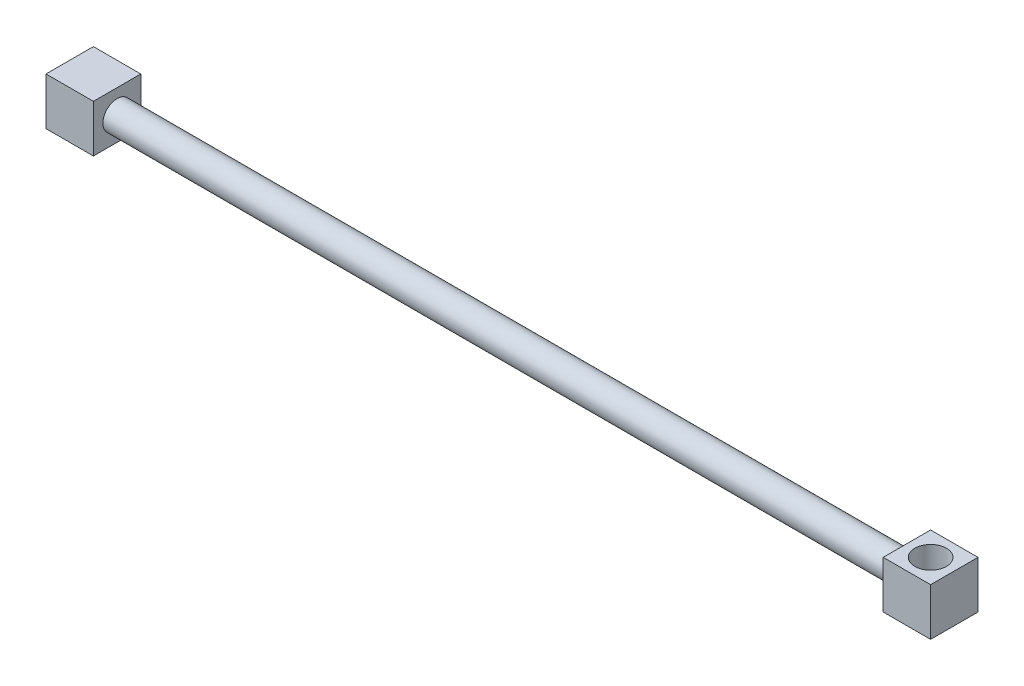
ISO-10303-21;
HEADER;
FILE_DESCRIPTION(('STEP AP214'),'2;1');
FILE_NAME('part.step','',(''),(''),'','','');
FILE_SCHEMA(('AUTOMOTIVE_DESIGN { 1 0 10303 214 1 1 1 1 }'));
ENDSEC;
DATA;
#1=APPLICATION_CONTEXT('core data for automotive mechanical design processes');
#2=APPLICATION_PROTOCOL_DEFINITION('international standard','automotive_design',2000,#1);
#3=PRODUCT_CONTEXT('',#1,'mechanical');
#4=PRODUCT('Part','Part','',(#3));
#5=PRODUCT_RELATED_PRODUCT_CATEGORY('part','',(#4));
#6=PRODUCT_DEFINITION_FORMATION('','',#4);
#7=PRODUCT_DEFINITION_CONTEXT('part definition',#1,'design');
#8=PRODUCT_DEFINITION('design','',#6,#7);
#9=PRODUCT_DEFINITION_SHAPE('','',#8);
#10=(LENGTH_UNIT() NAMED_UNIT(*) SI_UNIT(.MILLI.,.METRE.));
#11=(NAMED_UNIT(*) PLANE_ANGLE_UNIT() SI_UNIT($,.RADIAN.));
#12=(NAMED_UNIT(*) SI_UNIT($,.STERADIAN.) SOLID_ANGLE_UNIT());
#13=UNCERTAINTY_MEASURE_WITH_UNIT(LENGTH_MEASURE(1.E-05),#10,'distance_accuracy_value','');
#14=(GEOMETRIC_REPRESENTATION_CONTEXT(3) GLOBAL_UNCERTAINTY_ASSIGNED_CONTEXT((#13)) GLOBAL_UNIT_ASSIGNED_CONTEXT((#10,
#11,#12)) REPRESENTATION_CONTEXT('',''));
#15=CARTESIAN_POINT('',(0.,0.,0.));
#16=DIRECTION('',(0.,0.,1.));
#17=DIRECTION('',(1.,0.,0.));
#18=AXIS2_PLACEMENT_3D('',#15,#16,#17);
#19=CARTESIAN_POINT('',(30.,15.,-15.));
#20=DIRECTION('',(0.,0.,1.));
#21=DIRECTION('',(0.,-1.,0.));
#22=AXIS2_PLACEMENT_3D('',#19,#20,#21);
#23=PLANE('',#22);
#24=DIRECTION('',(0.,1.,0.));
#25=VECTOR('',#24,1.);
#26=CARTESIAN_POINT('',(0.,15.,-15.));
#27=LINE('',#26,#25);
#28=CARTESIAN_POINT('',(0.,-15.,-15.));
#29=VERTEX_POINT('',#28);
#30=CARTESIAN_POINT('',(0.,15.,-15.));
#31=VERTEX_POINT('',#30);
#32=EDGE_CURVE('E149',#29,#31,#27,.T.);
#33=ORIENTED_EDGE('',*,*,#32,.T.);
#34=DIRECTION('',(-1.,0.,0.));
#35=VECTOR('',#34,1.);
#36=CARTESIAN_POINT('',(30.,15.,-15.));
#37=LINE('',#36,#35);
#38=CARTESIAN_POINT('',(30.,15.,-15.));
#39=VERTEX_POINT('',#38);
#40=EDGE_CURVE('E42',#39,#31,#37,.T.);
#41=ORIENTED_EDGE('',*,*,#40,.F.);
#42=DIRECTION('',(0.,1.,0.));
#43=VECTOR('',#42,1.);
#44=CARTESIAN_POINT('',(30.,15.,-15.));
#45=LINE('',#44,#43);
#46=CARTESIAN_POINT('',(30.,-15.,-15.));
#47=VERTEX_POINT('',#46);
#48=EDGE_CURVE('E155',#47,#39,#45,.T.);
#49=ORIENTED_EDGE('',*,*,#48,.F.);
#50=DIRECTION('',(-1.,0.,0.));
#51=VECTOR('',#50,1.);
#52=CARTESIAN_POINT('',(30.,-15.,-15.));
#53=LINE('',#52,#51);
#54=EDGE_CURVE('E165',#47,#29,#53,.T.);
#55=ORIENTED_EDGE('',*,*,#54,.T.);
#56=EDGE_LOOP('',(#33,#41,#49,#55));
#57=FACE_BOUND('',#56,.T.);
#58=ADVANCED_FACE('F39',(#57),#23,.F.);
#59=CARTESIAN_POINT('',(30.,15.,15.));
#60=DIRECTION('',(0.,-1.,0.));
#61=DIRECTION('',(0.,0.,-1.));
#62=AXIS2_PLACEMENT_3D('',#59,#60,#61);
#63=PLANE('',#62);
#64=DIRECTION('',(0.,0.,1.));
#65=VECTOR('',#64,1.);
#66=CARTESIAN_POINT('',(0.,15.,15.));
#67=LINE('',#66,#65);
#68=CARTESIAN_POINT('',(0.,15.,15.));
#69=VERTEX_POINT('',#68);
#70=EDGE_CURVE('E169',#31,#69,#67,.T.);
#71=ORIENTED_EDGE('',*,*,#70,.T.);
#72=DIRECTION('',(-1.,0.,0.));
#73=VECTOR('',#72,1.);
#74=CARTESIAN_POINT('',(30.,15.,15.));
#75=LINE('',#74,#73);
#76=CARTESIAN_POINT('',(30.,15.,15.));
#77=VERTEX_POINT('',#76);
#78=EDGE_CURVE('E180',#77,#69,#75,.T.);
#79=ORIENTED_EDGE('',*,*,#78,.F.);
#80=DIRECTION('',(0.,0.,1.));
#81=VECTOR('',#80,1.);
#82=CARTESIAN_POINT('',(30.,15.,15.));
#83=LINE('',#82,#81);
#84=EDGE_CURVE('E89',#39,#77,#83,.T.);
#85=ORIENTED_EDGE('',*,*,#84,.F.);
#86=ORIENTED_EDGE('',*,*,#40,.T.);
#87=EDGE_LOOP('',(#71,#79,#85,#86));
#88=FACE_BOUND('',#87,.T.);
#89=ADVANCED_FACE('F185',(#88),#63,.F.);
#90=CARTESIAN_POINT('',(30.,15.,15.));
#91=DIRECTION('',(0.,0.,-1.));
#92=DIRECTION('',(0.,1.,0.));
#93=AXIS2_PLACEMENT_3D('',#90,#91,#92);
#94=PLANE('',#93);
#95=DIRECTION('',(0.,-1.,0.));
#96=VECTOR('',#95,1.);
#97=CARTESIAN_POINT('',(0.,15.,15.));
#98=LINE('',#97,#96);
#99=CARTESIAN_POINT('',(0.,-15.,15.));
#100=VERTEX_POINT('',#99);
#101=EDGE_CURVE('E75',#69,#100,#98,.T.);
#102=ORIENTED_EDGE('',*,*,#101,.T.);
#103=DIRECTION('',(-1.,0.,0.));
#104=VECTOR('',#103,1.);
#105=CARTESIAN_POINT('',(30.,-15.,15.));
#106=LINE('',#105,#104);
#107=CARTESIAN_POINT('',(30.,-15.,15.));
#108=VERTEX_POINT('',#107);
#109=EDGE_CURVE('E178',#108,#100,#106,.T.);
#110=ORIENTED_EDGE('',*,*,#109,.F.);
#111=DIRECTION('',(0.,-1.,0.));
#112=VECTOR('',#111,1.);
#113=CARTESIAN_POINT('',(30.,15.,15.));
#114=LINE('',#113,#112);
#115=EDGE_CURVE('E160',#77,#108,#114,.T.);
#116=ORIENTED_EDGE('',*,*,#115,.F.);
#117=ORIENTED_EDGE('',*,*,#78,.T.);
#118=EDGE_LOOP('',(#102,#110,#116,#117));
#119=FACE_BOUND('',#118,.T.);
#120=ADVANCED_FACE('F209',(#119),#94,.F.);
#121=CARTESIAN_POINT('',(30.,-15.,15.));
#122=DIRECTION('',(0.,1.,0.));
#123=DIRECTION('',(0.,0.,1.));
#124=AXIS2_PLACEMENT_3D('',#121,#122,#123);
#125=PLANE('',#124);
#126=DIRECTION('',(0.,0.,-1.));
#127=VECTOR('',#126,1.);
#128=CARTESIAN_POINT('',(0.,-15.,15.));
#129=LINE('',#128,#127);
#130=EDGE_CURVE('E81',#100,#29,#129,.T.);
#131=ORIENTED_EDGE('',*,*,#130,.T.);
#132=ORIENTED_EDGE('',*,*,#54,.F.);
#133=DIRECTION('',(0.,0.,-1.));
#134=VECTOR('',#133,1.);
#135=CARTESIAN_POINT('',(30.,-15.,15.));
#136=LINE('',#135,#134);
#137=EDGE_CURVE('E57',#108,#47,#136,.T.);
#138=ORIENTED_EDGE('',*,*,#137,.F.);
#139=ORIENTED_EDGE('',*,*,#109,.T.);
#140=EDGE_LOOP('',(#131,#132,#138,#139));
#141=FACE_BOUND('',#140,.T.);
#142=ADVANCED_FACE('F201',(#141),#125,.F.);
#143=CARTESIAN_POINT('',(30.,0.,0.));
#144=DIRECTION('',(1.,0.,0.));
#145=DIRECTION('',(0.,0.,-1.));
#146=AXIS2_PLACEMENT_3D('',#143,#144,#145);
#147=PLANE('',#146);
#148=CARTESIAN_POINT('',(30.,0.,0.));
#149=DIRECTION('',(1.,0.,0.));
#150=DIRECTION('',(0.,0.,-1.));
#151=AXIS2_PLACEMENT_3D('',#148,#149,#150);
#152=CIRCLE('',#151,9.);
#153=CARTESIAN_POINT('',(30.,0.,-9.));
#154=VERTEX_POINT('',#153);
#155=EDGE_CURVE('E11',#154,#154,#152,.T.);
#156=ORIENTED_EDGE('',*,*,#155,.F.);
#157=EDGE_LOOP('',(#156));
#158=FACE_BOUND('',#157,.T.);
#159=ORIENTED_EDGE('',*,*,#48,.T.);
#160=ORIENTED_EDGE('',*,*,#84,.T.);
#161=ORIENTED_EDGE('',*,*,#115,.T.);
#162=ORIENTED_EDGE('',*,*,#137,.T.);
#163=EDGE_LOOP('',(#159,#160,#161,#162));
#164=FACE_BOUND('',#163,.T.);
#165=ADVANCED_FACE('F193',(#158,#164),#147,.T.);
#166=CARTESIAN_POINT('',(0.,0.,0.));
#167=DIRECTION('',(1.,0.,0.));
#168=DIRECTION('',(0.,0.,-1.));
#169=AXIS2_PLACEMENT_3D('',#166,#167,#168);
#170=PLANE('',#169);
#171=ORIENTED_EDGE('',*,*,#32,.F.);
#172=ORIENTED_EDGE('',*,*,#130,.F.);
#173=ORIENTED_EDGE('',*,*,#101,.F.);
#174=ORIENTED_EDGE('',*,*,#70,.F.);
#175=EDGE_LOOP('',(#171,#172,#173,#174));
#176=FACE_BOUND('',#175,.T.);
#177=ADVANCED_FACE('F190',(#176),#170,.F.);
#178=CARTESIAN_POINT('',(530.,0.,0.));
#179=DIRECTION('',(-1.,0.,0.));
#180=DIRECTION('',(0.,0.,1.));
#181=AXIS2_PLACEMENT_3D('',#178,#179,#180);
#182=CYLINDRICAL_SURFACE('',#181,9.);
#183=CARTESIAN_POINT('',(530.,0.,0.));
#184=DIRECTION('',(1.,0.,0.));
#185=DIRECTION('',(0.,0.,-1.));
#186=AXIS2_PLACEMENT_3D('',#183,#184,#185);
#187=CIRCLE('',#186,9.);
#188=CARTESIAN_POINT('',(530.,0.,-9.));
#189=VERTEX_POINT('',#188);
#190=EDGE_CURVE('E144',#189,#189,#187,.T.);
#191=ORIENTED_EDGE('',*,*,#190,.F.);
#192=EDGE_LOOP('',(#191));
#193=FACE_BOUND('',#192,.T.);
#194=ORIENTED_EDGE('',*,*,#155,.T.);
#195=EDGE_LOOP('',(#194));
#196=FACE_BOUND('',#195,.T.);
#197=ADVANCED_FACE('F192',(#193,#196),#182,.T.);
#198=CARTESIAN_POINT('',(560.,-15.,-15.));
#199=DIRECTION('',(0.,0.,1.));
#200=DIRECTION('',(1.,0.,0.));
#201=AXIS2_PLACEMENT_3D('',#198,#199,#200);
#202=PLANE('',#201);
#203=DIRECTION('',(0.,1.,0.));
#204=VECTOR('',#203,1.);
#205=CARTESIAN_POINT('',(530.,-15.,-15.));
#206=LINE('',#205,#204);
#207=CARTESIAN_POINT('',(530.,-15.,-15.));
#208=VERTEX_POINT('',#207);
#209=CARTESIAN_POINT('',(530.,15.,-15.));
#210=VERTEX_POINT('',#209);
#211=EDGE_CURVE('E142',#208,#210,#206,.T.);
#212=ORIENTED_EDGE('',*,*,#211,.T.);
#213=DIRECTION('',(-1.,0.,0.));
#214=VECTOR('',#213,1.);
#215=CARTESIAN_POINT('',(560.,15.,-15.));
#216=LINE('',#215,#214);
#217=CARTESIAN_POINT('',(560.,15.,-15.));
#218=VERTEX_POINT('',#217);
#219=EDGE_CURVE('E120',#218,#210,#216,.T.);
#220=ORIENTED_EDGE('',*,*,#219,.F.);
#221=DIRECTION('',(0.,1.,0.));
#222=VECTOR('',#221,1.);
#223=CARTESIAN_POINT('',(560.,-15.,-15.));
#224=LINE('',#223,#222);
#225=CARTESIAN_POINT('',(560.,-15.,-15.));
#226=VERTEX_POINT('',#225);
#227=EDGE_CURVE('E128',#226,#218,#224,.T.);
#228=ORIENTED_EDGE('',*,*,#227,.F.);
#229=DIRECTION('',(-1.,0.,0.));
#230=VECTOR('',#229,1.);
#231=CARTESIAN_POINT('',(560.,-15.,-15.));
#232=LINE('',#231,#230);
#233=EDGE_CURVE('E316',#226,#208,#232,.T.);
#234=ORIENTED_EDGE('',*,*,#233,.T.);
#235=EDGE_LOOP('',(#212,#220,#228,#234));
#236=FACE_BOUND('',#235,.T.);
#237=ADVANCED_FACE('F140',(#236),#202,.F.);
#238=CARTESIAN_POINT('',(560.,15.,15.));
#239=DIRECTION('',(0.,-1.,0.));
#240=DIRECTION('',(0.,0.,-1.));
#241=AXIS2_PLACEMENT_3D('',#238,#239,#240);
#242=PLANE('',#241);
#243=CARTESIAN_POINT('',(545.,15.,0.));
#244=DIRECTION('',(0.,1.,0.));
#245=DIRECTION('',(0.,0.,1.));
#246=AXIS2_PLACEMENT_3D('',#243,#244,#245);
#247=CIRCLE('',#246,9.99999999999998);
#248=CARTESIAN_POINT('',(545.,15.,9.99999999999998));
#249=VERTEX_POINT('',#248);
#250=EDGE_CURVE('E306',#249,#249,#247,.T.);
#251=ORIENTED_EDGE('',*,*,#250,.F.);
#252=EDGE_LOOP('',(#251));
#253=FACE_BOUND('',#252,.T.);
#254=DIRECTION('',(0.,0.,1.));
#255=VECTOR('',#254,1.);
#256=CARTESIAN_POINT('',(530.,15.,15.));
#257=LINE('',#256,#255);
#258=CARTESIAN_POINT('',(530.,15.,15.));
#259=VERTEX_POINT('',#258);
#260=EDGE_CURVE('E319',#210,#259,#257,.T.);
#261=ORIENTED_EDGE('',*,*,#260,.T.);
#262=DIRECTION('',(-1.,0.,0.));
#263=VECTOR('',#262,1.);
#264=CARTESIAN_POINT('',(560.,15.,15.));
#265=LINE('',#264,#263);
#266=CARTESIAN_POINT('',(560.,15.,15.));
#267=VERTEX_POINT('',#266);
#268=EDGE_CURVE('E123',#267,#259,#265,.T.);
#269=ORIENTED_EDGE('',*,*,#268,.F.);
#270=DIRECTION('',(0.,0.,1.));
#271=VECTOR('',#270,1.);
#272=CARTESIAN_POINT('',(560.,15.,15.));
#273=LINE('',#272,#271);
#274=EDGE_CURVE('E116',#218,#267,#273,.T.);
#275=ORIENTED_EDGE('',*,*,#274,.F.);
#276=ORIENTED_EDGE('',*,*,#219,.T.);
#277=EDGE_LOOP('',(#261,#269,#275,#276));
#278=FACE_BOUND('',#277,.T.);
#279=ADVANCED_FACE('F118',(#253,#278),#242,.F.);
#280=CARTESIAN_POINT('',(560.,-15.,15.));
#281=DIRECTION('',(0.,0.,-1.));
#282=DIRECTION('',(-1.,0.,0.));
#283=AXIS2_PLACEMENT_3D('',#280,#281,#282);
#284=PLANE('',#283);
#285=DIRECTION('',(0.,-1.,0.));
#286=VECTOR('',#285,1.);
#287=CARTESIAN_POINT('',(530.,-15.,15.));
#288=LINE('',#287,#286);
#289=CARTESIAN_POINT('',(530.,-15.,15.));
#290=VERTEX_POINT('',#289);
#291=EDGE_CURVE('E322',#259,#290,#288,.T.);
#292=ORIENTED_EDGE('',*,*,#291,.T.);
#293=DIRECTION('',(-1.,0.,0.));
#294=VECTOR('',#293,1.);
#295=CARTESIAN_POINT('',(560.,-15.,15.));
#296=LINE('',#295,#294);
#297=CARTESIAN_POINT('',(560.,-15.,15.));
#298=VERTEX_POINT('',#297);
#299=EDGE_CURVE('E151',#298,#290,#296,.T.);
#300=ORIENTED_EDGE('',*,*,#299,.F.);
#301=DIRECTION('',(0.,-1.,0.));
#302=VECTOR('',#301,1.);
#303=CARTESIAN_POINT('',(560.,-15.,15.));
#304=LINE('',#303,#302);
#305=EDGE_CURVE('E127',#267,#298,#304,.T.);
#306=ORIENTED_EDGE('',*,*,#305,.F.);
#307=ORIENTED_EDGE('',*,*,#268,.T.);
#308=EDGE_LOOP('',(#292,#300,#306,#307));
#309=FACE_BOUND('',#308,.T.);
#310=ADVANCED_FACE('F246',(#309),#284,.F.);
#311=CARTESIAN_POINT('',(560.,-15.,15.));
#312=DIRECTION('',(0.,1.,0.));
#313=DIRECTION('',(0.,0.,1.));
#314=AXIS2_PLACEMENT_3D('',#311,#312,#313);
#315=PLANE('',#314);
#316=CARTESIAN_POINT('',(545.,-15.,0.));
#317=DIRECTION('',(0.,1.,0.));
#318=DIRECTION('',(0.,0.,1.));
#319=AXIS2_PLACEMENT_3D('',#316,#317,#318);
#320=CIRCLE('',#319,9.99999999999998);
#321=CARTESIAN_POINT('',(545.,-15.,9.99999999999998));
#322=VERTEX_POINT('',#321);
#323=EDGE_CURVE('E303',#322,#322,#320,.F.);
#324=ORIENTED_EDGE('',*,*,#323,.F.);
#325=EDGE_LOOP('',(#324));
#326=FACE_BOUND('',#325,.T.);
#327=DIRECTION('',(0.,0.,-1.));
#328=VECTOR('',#327,1.);
#329=CARTESIAN_POINT('',(530.,-15.,15.));
#330=LINE('',#329,#328);
#331=EDGE_CURVE('E138',#290,#208,#330,.T.);
#332=ORIENTED_EDGE('',*,*,#331,.T.);
#333=ORIENTED_EDGE('',*,*,#233,.F.);
#334=DIRECTION('',(0.,0.,-1.));
#335=VECTOR('',#334,1.);
#336=CARTESIAN_POINT('',(560.,-15.,15.));
#337=LINE('',#336,#335);
#338=EDGE_CURVE('E133',#298,#226,#337,.T.);
#339=ORIENTED_EDGE('',*,*,#338,.F.);
#340=ORIENTED_EDGE('',*,*,#299,.T.);
#341=EDGE_LOOP('',(#332,#333,#339,#340));
#342=FACE_BOUND('',#341,.T.);
#343=ADVANCED_FACE('F251',(#326,#342),#315,.F.);
#344=CARTESIAN_POINT('',(560.,0.,0.));
#345=DIRECTION('',(-1.,0.,0.));
#346=DIRECTION('',(0.,0.,1.));
#347=AXIS2_PLACEMENT_3D('',#344,#345,#346);
#348=PLANE('',#347);
#349=ORIENTED_EDGE('',*,*,#227,.T.);
#350=ORIENTED_EDGE('',*,*,#274,.T.);
#351=ORIENTED_EDGE('',*,*,#305,.T.);
#352=ORIENTED_EDGE('',*,*,#338,.T.);
#353=EDGE_LOOP('',(#349,#350,#351,#352));
#354=FACE_BOUND('',#353,.T.);
#355=ADVANCED_FACE('F131',(#354),#348,.F.);
#356=CARTESIAN_POINT('',(530.,0.,0.));
#357=DIRECTION('',(-1.,0.,0.));
#358=DIRECTION('',(0.,0.,1.));
#359=AXIS2_PLACEMENT_3D('',#356,#357,#358);
#360=PLANE('',#359);
#361=ORIENTED_EDGE('',*,*,#190,.T.);
#362=EDGE_LOOP('',(#361));
#363=FACE_BOUND('',#362,.T.);
#364=ORIENTED_EDGE('',*,*,#211,.F.);
#365=ORIENTED_EDGE('',*,*,#331,.F.);
#366=ORIENTED_EDGE('',*,*,#291,.F.);
#367=ORIENTED_EDGE('',*,*,#260,.F.);
#368=EDGE_LOOP('',(#364,#365,#366,#367));
#369=FACE_BOUND('',#368,.T.);
#370=ADVANCED_FACE('F263',(#363,#369),#360,.T.);
#371=CARTESIAN_POINT('',(545.,-43.2842712474619,0.));
#372=DIRECTION('',(0.,1.,0.));
#373=DIRECTION('',(0.,0.,1.));
#374=AXIS2_PLACEMENT_3D('',#371,#372,#373);
#375=CYLINDRICAL_SURFACE('',#374,9.99999999999998);
#376=ORIENTED_EDGE('',*,*,#323,.T.);
#377=EDGE_LOOP('',(#376));
#378=FACE_BOUND('',#377,.T.);
#379=ORIENTED_EDGE('',*,*,#250,.T.);
#380=EDGE_LOOP('',(#379));
#381=FACE_BOUND('',#380,.T.);
#382=ADVANCED_FACE('F272',(#378,#381),#375,.F.);
#383=CLOSED_SHELL('',(#58,#89,#120,#142,#165,#177,#197,#237,#279,#310,#343,#355,#370,#382));
#384=MANIFOLD_SOLID_BREP('B2',#383);
#385=ADVANCED_BREP_SHAPE_REPRESENTATION('',(#18,#384),#14);
#386=SHAPE_DEFINITION_REPRESENTATION(#9,#385);
ENDSEC;
END-ISO-10303-21;
